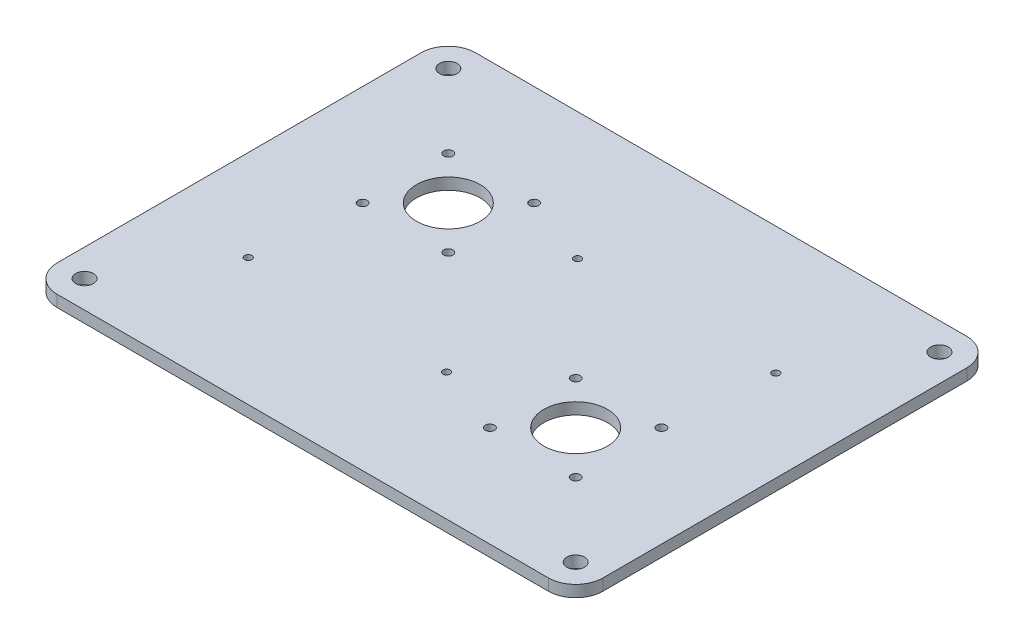
ISO-10303-21;
HEADER;
FILE_DESCRIPTION(('STEP AP214'),'2;1');
FILE_NAME('part.step','',(''),(''),'','','');
FILE_SCHEMA(('AUTOMOTIVE_DESIGN { 1 0 10303 214 1 1 1 1 }'));
ENDSEC;
DATA;
#1=APPLICATION_CONTEXT('core data for automotive mechanical design processes');
#2=APPLICATION_PROTOCOL_DEFINITION('international standard','automotive_design',2000,#1);
#3=PRODUCT_CONTEXT('',#1,'mechanical');
#4=PRODUCT('Part','Part','',(#3));
#5=PRODUCT_RELATED_PRODUCT_CATEGORY('part','',(#4));
#6=PRODUCT_DEFINITION_FORMATION('','',#4);
#7=PRODUCT_DEFINITION_CONTEXT('part definition',#1,'design');
#8=PRODUCT_DEFINITION('design','',#6,#7);
#9=PRODUCT_DEFINITION_SHAPE('','',#8);
#10=(LENGTH_UNIT() NAMED_UNIT(*) SI_UNIT(.MILLI.,.METRE.));
#11=(NAMED_UNIT(*) PLANE_ANGLE_UNIT() SI_UNIT($,.RADIAN.));
#12=(NAMED_UNIT(*) SI_UNIT($,.STERADIAN.) SOLID_ANGLE_UNIT());
#13=UNCERTAINTY_MEASURE_WITH_UNIT(LENGTH_MEASURE(1.E-05),#10,'distance_accuracy_value','');
#14=(GEOMETRIC_REPRESENTATION_CONTEXT(3) GLOBAL_UNCERTAINTY_ASSIGNED_CONTEXT((#13)) GLOBAL_UNIT_ASSIGNED_CONTEXT((#10,
#11,#12)) REPRESENTATION_CONTEXT('',''));
#15=CARTESIAN_POINT('',(0.,0.,0.));
#16=DIRECTION('',(0.,0.,1.));
#17=DIRECTION('',(1.,0.,0.));
#18=AXIS2_PLACEMENT_3D('',#15,#16,#17);
#19=CARTESIAN_POINT('',(-132.651439050945,6.35,-150.421561198845));
#20=DIRECTION('',(0.,-1.,0.));
#21=DIRECTION('',(0.,0.,-1.));
#22=AXIS2_PLACEMENT_3D('',#19,#20,#21);
#23=CYLINDRICAL_SURFACE('',#22,15.);
#24=CARTESIAN_POINT('',(-132.651439050945,0.,-150.421561198845));
#25=DIRECTION('',(0.,1.,0.));
#26=DIRECTION('',(0.,0.,1.));
#27=AXIS2_PLACEMENT_3D('',#24,#25,#26);
#28=CIRCLE('',#27,15.);
#29=CARTESIAN_POINT('',(-147.651439050945,0.,-150.421561198845));
#30=VERTEX_POINT('',#29);
#31=CARTESIAN_POINT('',(-132.651439050945,0.,-165.421561198845));
#32=VERTEX_POINT('',#31);
#33=EDGE_CURVE('E181',#30,#32,#28,.F.);
#34=ORIENTED_EDGE('',*,*,#33,.F.);
#35=DIRECTION('',(0.,-1.,0.));
#36=VECTOR('',#35,1.);
#37=CARTESIAN_POINT('',(-147.651439050945,6.35,-150.421561198845));
#38=LINE('',#37,#36);
#39=CARTESIAN_POINT('',(-147.651439050945,6.35,-150.421561198845));
#40=VERTEX_POINT('',#39);
#41=EDGE_CURVE('E11',#40,#30,#38,.T.);
#42=ORIENTED_EDGE('',*,*,#41,.F.);
#43=CARTESIAN_POINT('',(-132.651439050945,6.35,-150.421561198845));
#44=DIRECTION('',(0.,1.,0.));
#45=DIRECTION('',(0.,0.,1.));
#46=AXIS2_PLACEMENT_3D('',#43,#44,#45);
#47=CIRCLE('',#46,15.);
#48=CARTESIAN_POINT('',(-132.651439050945,6.35,-165.421561198845));
#49=VERTEX_POINT('',#48);
#50=EDGE_CURVE('E566',#40,#49,#47,.F.);
#51=ORIENTED_EDGE('',*,*,#50,.T.);
#52=DIRECTION('',(0.,-1.,0.));
#53=VECTOR('',#52,1.);
#54=CARTESIAN_POINT('',(-132.651439050945,6.35,-165.421561198845));
#55=LINE('',#54,#53);
#56=EDGE_CURVE('E58',#49,#32,#55,.T.);
#57=ORIENTED_EDGE('',*,*,#56,.T.);
#58=EDGE_LOOP('',(#34,#42,#51,#57));
#59=FACE_BOUND('',#58,.T.);
#60=ADVANCED_FACE('F41',(#59),#23,.T.);
#61=CARTESIAN_POINT('',(-147.651439050945,6.35,0.));
#62=DIRECTION('',(1.,0.,0.));
#63=DIRECTION('',(0.,0.,-1.));
#64=AXIS2_PLACEMENT_3D('',#61,#62,#63);
#65=PLANE('',#64);
#66=DIRECTION('',(0.,0.,1.));
#67=VECTOR('',#66,1.);
#68=CARTESIAN_POINT('',(-147.651439050945,0.,0.));
#69=LINE('',#68,#67);
#70=CARTESIAN_POINT('',(-147.651439050945,0.,49.578438801155));
#71=VERTEX_POINT('',#70);
#72=EDGE_CURVE('E183',#30,#71,#69,.T.);
#73=ORIENTED_EDGE('',*,*,#72,.T.);
#74=DIRECTION('',(0.,-1.,0.));
#75=VECTOR('',#74,1.);
#76=CARTESIAN_POINT('',(-147.651439050945,6.35,49.578438801155));
#77=LINE('',#76,#75);
#78=CARTESIAN_POINT('',(-147.651439050945,6.35,49.578438801155));
#79=VERTEX_POINT('',#78);
#80=EDGE_CURVE('E50',#79,#71,#77,.T.);
#81=ORIENTED_EDGE('',*,*,#80,.F.);
#82=DIRECTION('',(0.,0.,1.));
#83=VECTOR('',#82,1.);
#84=CARTESIAN_POINT('',(-147.651439050945,6.35,0.));
#85=LINE('',#84,#83);
#86=EDGE_CURVE('E568',#40,#79,#85,.T.);
#87=ORIENTED_EDGE('',*,*,#86,.F.);
#88=ORIENTED_EDGE('',*,*,#41,.T.);
#89=EDGE_LOOP('',(#73,#81,#87,#88));
#90=FACE_BOUND('',#89,.T.);
#91=ADVANCED_FACE('F225',(#90),#65,.F.);
#92=CARTESIAN_POINT('',(-132.651439050945,6.35,49.578438801155));
#93=DIRECTION('',(0.,-1.,0.));
#94=DIRECTION('',(0.,0.,-1.));
#95=AXIS2_PLACEMENT_3D('',#92,#93,#94);
#96=CYLINDRICAL_SURFACE('',#95,15.);
#97=CARTESIAN_POINT('',(-132.651439050945,0.,49.578438801155));
#98=DIRECTION('',(0.,1.,0.));
#99=DIRECTION('',(0.,0.,1.));
#100=AXIS2_PLACEMENT_3D('',#97,#98,#99);
#101=CIRCLE('',#100,15.);
#102=CARTESIAN_POINT('',(-132.651439050945,0.,64.578438801155));
#103=VERTEX_POINT('',#102);
#104=EDGE_CURVE('E186',#71,#103,#101,.T.);
#105=ORIENTED_EDGE('',*,*,#104,.T.);
#106=DIRECTION('',(0.,-1.,0.));
#107=VECTOR('',#106,1.);
#108=CARTESIAN_POINT('',(-132.651439050945,6.35,64.578438801155));
#109=LINE('',#108,#107);
#110=CARTESIAN_POINT('',(-132.651439050945,6.35,64.578438801155));
#111=VERTEX_POINT('',#110);
#112=EDGE_CURVE('E213',#111,#103,#109,.T.);
#113=ORIENTED_EDGE('',*,*,#112,.F.);
#114=CARTESIAN_POINT('',(-132.651439050945,6.35,49.578438801155));
#115=DIRECTION('',(0.,1.,0.));
#116=DIRECTION('',(0.,0.,1.));
#117=AXIS2_PLACEMENT_3D('',#114,#115,#116);
#118=CIRCLE('',#117,15.);
#119=EDGE_CURVE('E221',#79,#111,#118,.T.);
#120=ORIENTED_EDGE('',*,*,#119,.F.);
#121=ORIENTED_EDGE('',*,*,#80,.T.);
#122=EDGE_LOOP('',(#105,#113,#120,#121));
#123=FACE_BOUND('',#122,.T.);
#124=ADVANCED_FACE('F218',(#123),#96,.T.);
#125=CARTESIAN_POINT('',(0.,6.35,64.578438801155));
#126=DIRECTION('',(0.,0.,-1.));
#127=DIRECTION('',(-1.,0.,0.));
#128=AXIS2_PLACEMENT_3D('',#125,#126,#127);
#129=PLANE('',#128);
#130=DIRECTION('',(1.,0.,0.));
#131=VECTOR('',#130,1.);
#132=CARTESIAN_POINT('',(0.,0.,64.578438801155));
#133=LINE('',#132,#131);
#134=CARTESIAN_POINT('',(137.348560949055,0.,64.578438801155));
#135=VERTEX_POINT('',#134);
#136=EDGE_CURVE('E189',#103,#135,#133,.T.);
#137=ORIENTED_EDGE('',*,*,#136,.T.);
#138=DIRECTION('',(0.,-1.,0.));
#139=VECTOR('',#138,1.);
#140=CARTESIAN_POINT('',(137.348560949055,6.35,64.578438801155));
#141=LINE('',#140,#139);
#142=CARTESIAN_POINT('',(137.348560949055,6.35,64.578438801155));
#143=VERTEX_POINT('',#142);
#144=EDGE_CURVE('E211',#143,#135,#141,.T.);
#145=ORIENTED_EDGE('',*,*,#144,.F.);
#146=DIRECTION('',(1.,0.,0.));
#147=VECTOR('',#146,1.);
#148=CARTESIAN_POINT('',(0.,6.35,64.578438801155));
#149=LINE('',#148,#147);
#150=EDGE_CURVE('E133',#111,#143,#149,.T.);
#151=ORIENTED_EDGE('',*,*,#150,.F.);
#152=ORIENTED_EDGE('',*,*,#112,.T.);
#153=EDGE_LOOP('',(#137,#145,#151,#152));
#154=FACE_BOUND('',#153,.T.);
#155=ADVANCED_FACE('F353',(#154),#129,.F.);
#156=CARTESIAN_POINT('',(137.348560949055,6.35,49.578438801155));
#157=DIRECTION('',(0.,-1.,0.));
#158=DIRECTION('',(0.,0.,-1.));
#159=AXIS2_PLACEMENT_3D('',#156,#157,#158);
#160=CYLINDRICAL_SURFACE('',#159,15.);
#161=CARTESIAN_POINT('',(137.348560949055,0.,49.578438801155));
#162=DIRECTION('',(0.,1.,0.));
#163=DIRECTION('',(0.,0.,1.));
#164=AXIS2_PLACEMENT_3D('',#161,#162,#163);
#165=CIRCLE('',#164,15.);
#166=CARTESIAN_POINT('',(152.348560949055,0.,49.578438801155));
#167=VERTEX_POINT('',#166);
#168=EDGE_CURVE('E192',#167,#135,#165,.F.);
#169=ORIENTED_EDGE('',*,*,#168,.F.);
#170=DIRECTION('',(0.,-1.,0.));
#171=VECTOR('',#170,1.);
#172=CARTESIAN_POINT('',(152.348560949055,6.35,49.578438801155));
#173=LINE('',#172,#171);
#174=CARTESIAN_POINT('',(152.348560949055,6.35,49.578438801155));
#175=VERTEX_POINT('',#174);
#176=EDGE_CURVE('E118',#175,#167,#173,.T.);
#177=ORIENTED_EDGE('',*,*,#176,.F.);
#178=CARTESIAN_POINT('',(137.348560949055,6.35,49.578438801155));
#179=DIRECTION('',(0.,1.,0.));
#180=DIRECTION('',(0.,0.,1.));
#181=AXIS2_PLACEMENT_3D('',#178,#179,#180);
#182=CIRCLE('',#181,15.);
#183=EDGE_CURVE('E131',#175,#143,#182,.F.);
#184=ORIENTED_EDGE('',*,*,#183,.T.);
#185=ORIENTED_EDGE('',*,*,#144,.T.);
#186=EDGE_LOOP('',(#169,#177,#184,#185));
#187=FACE_BOUND('',#186,.T.);
#188=ADVANCED_FACE('F350',(#187),#160,.T.);
#189=CARTESIAN_POINT('',(152.348560949055,6.35,0.));
#190=DIRECTION('',(1.,0.,0.));
#191=DIRECTION('',(0.,0.,-1.));
#192=AXIS2_PLACEMENT_3D('',#189,#190,#191);
#193=PLANE('',#192);
#194=DIRECTION('',(0.,0.,1.));
#195=VECTOR('',#194,1.);
#196=CARTESIAN_POINT('',(152.348560949055,0.,0.));
#197=LINE('',#196,#195);
#198=CARTESIAN_POINT('',(152.348560949055,0.,-150.421561198845));
#199=VERTEX_POINT('',#198);
#200=EDGE_CURVE('E115',#199,#167,#197,.T.);
#201=ORIENTED_EDGE('',*,*,#200,.F.);
#202=DIRECTION('',(0.,-1.,0.));
#203=VECTOR('',#202,1.);
#204=CARTESIAN_POINT('',(152.348560949055,6.35,-150.421561198845));
#205=LINE('',#204,#203);
#206=CARTESIAN_POINT('',(152.348560949055,6.35,-150.421561198845));
#207=VERTEX_POINT('',#206);
#208=EDGE_CURVE('E109',#207,#199,#205,.T.);
#209=ORIENTED_EDGE('',*,*,#208,.F.);
#210=DIRECTION('',(0.,0.,1.));
#211=VECTOR('',#210,1.);
#212=CARTESIAN_POINT('',(152.348560949055,6.35,0.));
#213=LINE('',#212,#211);
#214=EDGE_CURVE('E113',#207,#175,#213,.T.);
#215=ORIENTED_EDGE('',*,*,#214,.T.);
#216=ORIENTED_EDGE('',*,*,#176,.T.);
#217=EDGE_LOOP('',(#201,#209,#215,#216));
#218=FACE_BOUND('',#217,.T.);
#219=ADVANCED_FACE('F111',(#218),#193,.T.);
#220=CARTESIAN_POINT('',(137.348560949055,6.35,-150.421561198845));
#221=DIRECTION('',(0.,-1.,0.));
#222=DIRECTION('',(0.,0.,-1.));
#223=AXIS2_PLACEMENT_3D('',#220,#221,#222);
#224=CYLINDRICAL_SURFACE('',#223,15.);
#225=CARTESIAN_POINT('',(137.348560949055,0.,-150.421561198845));
#226=DIRECTION('',(0.,1.,0.));
#227=DIRECTION('',(0.,0.,1.));
#228=AXIS2_PLACEMENT_3D('',#225,#226,#227);
#229=CIRCLE('',#228,15.);
#230=CARTESIAN_POINT('',(137.348560949055,0.,-165.421561198845));
#231=VERTEX_POINT('',#230);
#232=EDGE_CURVE('E196',#199,#231,#229,.T.);
#233=ORIENTED_EDGE('',*,*,#232,.T.);
#234=DIRECTION('',(0.,-1.,0.));
#235=VECTOR('',#234,1.);
#236=CARTESIAN_POINT('',(137.348560949055,6.35,-165.421561198845));
#237=LINE('',#236,#235);
#238=CARTESIAN_POINT('',(137.348560949055,6.35,-165.421561198845));
#239=VERTEX_POINT('',#238);
#240=EDGE_CURVE('E84',#239,#231,#237,.T.);
#241=ORIENTED_EDGE('',*,*,#240,.F.);
#242=CARTESIAN_POINT('',(137.348560949055,6.35,-150.421561198845));
#243=DIRECTION('',(0.,1.,0.));
#244=DIRECTION('',(0.,0.,1.));
#245=AXIS2_PLACEMENT_3D('',#242,#243,#244);
#246=CIRCLE('',#245,15.);
#247=EDGE_CURVE('E120',#207,#239,#246,.T.);
#248=ORIENTED_EDGE('',*,*,#247,.F.);
#249=ORIENTED_EDGE('',*,*,#208,.T.);
#250=EDGE_LOOP('',(#233,#241,#248,#249));
#251=FACE_BOUND('',#250,.T.);
#252=ADVANCED_FACE('F121',(#251),#224,.T.);
#253=CARTESIAN_POINT('',(-132.651439050945,6.35,-150.421561198845));
#254=DIRECTION('',(0.,-1.,0.));
#255=DIRECTION('',(0.,0.,-1.));
#256=AXIS2_PLACEMENT_3D('',#253,#254,#255);
#257=CYLINDRICAL_SURFACE('',#256,4.85);
#258=CARTESIAN_POINT('',(-132.651439050945,6.35,-150.421561198845));
#259=DIRECTION('',(0.,1.,0.));
#260=DIRECTION('',(0.,0.,1.));
#261=AXIS2_PLACEMENT_3D('',#258,#259,#260);
#262=CIRCLE('',#261,4.85);
#263=CARTESIAN_POINT('',(-132.651439050945,6.35,-145.571561198845));
#264=VERTEX_POINT('',#263);
#265=EDGE_CURVE('E138',#264,#264,#262,.T.);
#266=ORIENTED_EDGE('',*,*,#265,.T.);
#267=EDGE_LOOP('',(#266));
#268=FACE_BOUND('',#267,.T.);
#269=CARTESIAN_POINT('',(-132.651439050945,0.,-150.421561198845));
#270=DIRECTION('',(0.,1.,0.));
#271=DIRECTION('',(0.,0.,1.));
#272=AXIS2_PLACEMENT_3D('',#269,#270,#271);
#273=CIRCLE('',#272,4.85);
#274=CARTESIAN_POINT('',(-132.651439050945,0.,-145.571561198845));
#275=VERTEX_POINT('',#274);
#276=EDGE_CURVE('E201',#275,#275,#273,.T.);
#277=ORIENTED_EDGE('',*,*,#276,.F.);
#278=EDGE_LOOP('',(#277));
#279=FACE_BOUND('',#278,.T.);
#280=ADVANCED_FACE('F340',(#268,#279),#257,.F.);
#281=CARTESIAN_POINT('',(0.,6.35,-165.421561198845));
#282=DIRECTION('',(0.,0.,-1.));
#283=DIRECTION('',(-1.,0.,0.));
#284=AXIS2_PLACEMENT_3D('',#281,#282,#283);
#285=PLANE('',#284);
#286=DIRECTION('',(1.,0.,0.));
#287=VECTOR('',#286,1.);
#288=CARTESIAN_POINT('',(0.,0.,-165.421561198845));
#289=LINE('',#288,#287);
#290=EDGE_CURVE('E198',#32,#231,#289,.T.);
#291=ORIENTED_EDGE('',*,*,#290,.F.);
#292=ORIENTED_EDGE('',*,*,#56,.F.);
#293=DIRECTION('',(1.,0.,0.));
#294=VECTOR('',#293,1.);
#295=CARTESIAN_POINT('',(0.,6.35,-165.421561198845));
#296=LINE('',#295,#294);
#297=EDGE_CURVE('E124',#49,#239,#296,.T.);
#298=ORIENTED_EDGE('',*,*,#297,.T.);
#299=ORIENTED_EDGE('',*,*,#240,.T.);
#300=EDGE_LOOP('',(#291,#292,#298,#299));
#301=FACE_BOUND('',#300,.T.);
#302=ADVANCED_FACE('F241',(#301),#285,.T.);
#303=CARTESIAN_POINT('',(137.348560949055,6.35,49.578438801155));
#304=DIRECTION('',(0.,-1.,0.));
#305=DIRECTION('',(0.,0.,-1.));
#306=AXIS2_PLACEMENT_3D('',#303,#304,#305);
#307=CYLINDRICAL_SURFACE('',#306,4.85);
#308=CARTESIAN_POINT('',(137.348560949055,6.35,49.578438801155));
#309=DIRECTION('',(0.,1.,0.));
#310=DIRECTION('',(0.,0.,1.));
#311=AXIS2_PLACEMENT_3D('',#308,#309,#310);
#312=CIRCLE('',#311,4.85);
#313=CARTESIAN_POINT('',(137.348560949055,6.35,54.428438801155));
#314=VERTEX_POINT('',#313);
#315=EDGE_CURVE('E563',#314,#314,#312,.T.);
#316=ORIENTED_EDGE('',*,*,#315,.T.);
#317=EDGE_LOOP('',(#316));
#318=FACE_BOUND('',#317,.T.);
#319=CARTESIAN_POINT('',(137.348560949055,0.,49.578438801155));
#320=DIRECTION('',(0.,1.,0.));
#321=DIRECTION('',(0.,0.,1.));
#322=AXIS2_PLACEMENT_3D('',#319,#320,#321);
#323=CIRCLE('',#322,4.85);
#324=CARTESIAN_POINT('',(137.348560949055,0.,54.428438801155));
#325=VERTEX_POINT('',#324);
#326=EDGE_CURVE('E178',#325,#325,#323,.T.);
#327=ORIENTED_EDGE('',*,*,#326,.F.);
#328=EDGE_LOOP('',(#327));
#329=FACE_BOUND('',#328,.T.);
#330=ADVANCED_FACE('F237',(#318,#329),#307,.F.);
#331=CARTESIAN_POINT('',(-45.0814390509446,6.35,-109.991561198845));
#332=DIRECTION('',(0.,-1.,0.));
#333=DIRECTION('',(0.,0.,-1.));
#334=AXIS2_PLACEMENT_3D('',#331,#332,#333);
#335=CYLINDRICAL_SURFACE('',#334,2.5);
#336=CARTESIAN_POINT('',(-45.0814390509446,6.35,-109.991561198845));
#337=DIRECTION('',(0.,1.,0.));
#338=DIRECTION('',(0.,0.,1.));
#339=AXIS2_PLACEMENT_3D('',#336,#337,#338);
#340=CIRCLE('',#339,2.5);
#341=CARTESIAN_POINT('',(-45.0814390509446,6.35,-107.491561198845));
#342=VERTEX_POINT('',#341);
#343=EDGE_CURVE('E560',#342,#342,#340,.T.);
#344=ORIENTED_EDGE('',*,*,#343,.T.);
#345=EDGE_LOOP('',(#344));
#346=FACE_BOUND('',#345,.T.);
#347=CARTESIAN_POINT('',(-45.0814390509446,0.,-109.991561198845));
#348=DIRECTION('',(0.,1.,0.));
#349=DIRECTION('',(0.,0.,1.));
#350=AXIS2_PLACEMENT_3D('',#347,#348,#349);
#351=CIRCLE('',#350,2.5);
#352=CARTESIAN_POINT('',(-45.0814390509446,0.,-107.491561198845));
#353=VERTEX_POINT('',#352);
#354=EDGE_CURVE('E175',#353,#353,#351,.T.);
#355=ORIENTED_EDGE('',*,*,#354,.F.);
#356=EDGE_LOOP('',(#355));
#357=FACE_BOUND('',#356,.T.);
#358=ADVANCED_FACE('F240',(#346,#357),#335,.F.);
#359=CARTESIAN_POINT('',(-45.0814390509446,6.35,-62.851561198845));
#360=DIRECTION('',(0.,-1.,0.));
#361=DIRECTION('',(0.,0.,-1.));
#362=AXIS2_PLACEMENT_3D('',#359,#360,#361);
#363=CYLINDRICAL_SURFACE('',#362,2.5);
#364=CARTESIAN_POINT('',(-45.0814390509446,6.35,-62.851561198845));
#365=DIRECTION('',(0.,1.,0.));
#366=DIRECTION('',(0.,0.,1.));
#367=AXIS2_PLACEMENT_3D('',#364,#365,#366);
#368=CIRCLE('',#367,2.5);
#369=CARTESIAN_POINT('',(-45.0814390509446,6.35,-60.351561198845));
#370=VERTEX_POINT('',#369);
#371=EDGE_CURVE('E557',#370,#370,#368,.T.);
#372=ORIENTED_EDGE('',*,*,#371,.T.);
#373=EDGE_LOOP('',(#372));
#374=FACE_BOUND('',#373,.T.);
#375=CARTESIAN_POINT('',(-45.0814390509446,0.,-62.851561198845));
#376=DIRECTION('',(0.,1.,0.));
#377=DIRECTION('',(0.,0.,1.));
#378=AXIS2_PLACEMENT_3D('',#375,#376,#377);
#379=CIRCLE('',#378,2.5);
#380=CARTESIAN_POINT('',(-45.0814390509446,0.,-60.351561198845));
#381=VERTEX_POINT('',#380);
#382=EDGE_CURVE('E172',#381,#381,#379,.T.);
#383=ORIENTED_EDGE('',*,*,#382,.F.);
#384=EDGE_LOOP('',(#383));
#385=FACE_BOUND('',#384,.T.);
#386=ADVANCED_FACE('F245',(#374,#385),#363,.F.);
#387=CARTESIAN_POINT('',(-92.2214390509446,6.35,-62.851561198845));
#388=DIRECTION('',(0.,-1.,0.));
#389=DIRECTION('',(0.,0.,-1.));
#390=AXIS2_PLACEMENT_3D('',#387,#388,#389);
#391=CYLINDRICAL_SURFACE('',#390,2.50000000000001);
#392=CARTESIAN_POINT('',(-92.2214390509446,6.35,-62.851561198845));
#393=DIRECTION('',(0.,1.,0.));
#394=DIRECTION('',(0.,0.,1.));
#395=AXIS2_PLACEMENT_3D('',#392,#393,#394);
#396=CIRCLE('',#395,2.50000000000001);
#397=CARTESIAN_POINT('',(-92.2214390509446,6.35,-60.351561198845));
#398=VERTEX_POINT('',#397);
#399=EDGE_CURVE('E554',#398,#398,#396,.T.);
#400=ORIENTED_EDGE('',*,*,#399,.T.);
#401=EDGE_LOOP('',(#400));
#402=FACE_BOUND('',#401,.T.);
#403=CARTESIAN_POINT('',(-92.2214390509446,0.,-62.851561198845));
#404=DIRECTION('',(0.,1.,0.));
#405=DIRECTION('',(0.,0.,1.));
#406=AXIS2_PLACEMENT_3D('',#403,#404,#405);
#407=CIRCLE('',#406,2.50000000000001);
#408=CARTESIAN_POINT('',(-92.2214390509446,0.,-60.351561198845));
#409=VERTEX_POINT('',#408);
#410=EDGE_CURVE('E169',#409,#409,#407,.T.);
#411=ORIENTED_EDGE('',*,*,#410,.F.);
#412=EDGE_LOOP('',(#411));
#413=FACE_BOUND('',#412,.T.);
#414=ADVANCED_FACE('F249',(#402,#413),#391,.F.);
#415=CARTESIAN_POINT('',(-92.2214390509446,6.35,-109.991561198845));
#416=DIRECTION('',(0.,-1.,0.));
#417=DIRECTION('',(0.,0.,-1.));
#418=AXIS2_PLACEMENT_3D('',#415,#416,#417);
#419=CYLINDRICAL_SURFACE('',#418,2.5);
#420=CARTESIAN_POINT('',(-92.2214390509446,6.35,-109.991561198845));
#421=DIRECTION('',(0.,1.,0.));
#422=DIRECTION('',(0.,0.,1.));
#423=AXIS2_PLACEMENT_3D('',#420,#421,#422);
#424=CIRCLE('',#423,2.5);
#425=CARTESIAN_POINT('',(-92.2214390509446,6.35,-107.491561198845));
#426=VERTEX_POINT('',#425);
#427=EDGE_CURVE('E551',#426,#426,#424,.T.);
#428=ORIENTED_EDGE('',*,*,#427,.T.);
#429=EDGE_LOOP('',(#428));
#430=FACE_BOUND('',#429,.T.);
#431=CARTESIAN_POINT('',(-92.2214390509446,0.,-109.991561198845));
#432=DIRECTION('',(0.,1.,0.));
#433=DIRECTION('',(0.,0.,1.));
#434=AXIS2_PLACEMENT_3D('',#431,#432,#433);
#435=CIRCLE('',#434,2.5);
#436=CARTESIAN_POINT('',(-92.2214390509446,0.,-107.491561198845));
#437=VERTEX_POINT('',#436);
#438=EDGE_CURVE('E166',#437,#437,#435,.T.);
#439=ORIENTED_EDGE('',*,*,#438,.F.);
#440=EDGE_LOOP('',(#439));
#441=FACE_BOUND('',#440,.T.);
#442=ADVANCED_FACE('F253',(#430,#441),#419,.F.);
#443=CARTESIAN_POINT('',(49.7785609490553,6.35,-37.991561198845));
#444=DIRECTION('',(0.,-1.,0.));
#445=DIRECTION('',(0.,0.,-1.));
#446=AXIS2_PLACEMENT_3D('',#443,#444,#445);
#447=CYLINDRICAL_SURFACE('',#446,2.5);
#448=CARTESIAN_POINT('',(49.7785609490553,6.35,-37.991561198845));
#449=DIRECTION('',(0.,1.,0.));
#450=DIRECTION('',(0.,0.,1.));
#451=AXIS2_PLACEMENT_3D('',#448,#449,#450);
#452=CIRCLE('',#451,2.5);
#453=CARTESIAN_POINT('',(49.7785609490553,6.35,-35.491561198845));
#454=VERTEX_POINT('',#453);
#455=EDGE_CURVE('E548',#454,#454,#452,.T.);
#456=ORIENTED_EDGE('',*,*,#455,.T.);
#457=EDGE_LOOP('',(#456));
#458=FACE_BOUND('',#457,.T.);
#459=CARTESIAN_POINT('',(49.7785609490553,0.,-37.991561198845));
#460=DIRECTION('',(0.,1.,0.));
#461=DIRECTION('',(0.,0.,1.));
#462=AXIS2_PLACEMENT_3D('',#459,#460,#461);
#463=CIRCLE('',#462,2.5);
#464=CARTESIAN_POINT('',(49.7785609490553,0.,-35.491561198845));
#465=VERTEX_POINT('',#464);
#466=EDGE_CURVE('E163',#465,#465,#463,.T.);
#467=ORIENTED_EDGE('',*,*,#466,.F.);
#468=EDGE_LOOP('',(#467));
#469=FACE_BOUND('',#468,.T.);
#470=ADVANCED_FACE('F257',(#458,#469),#447,.F.);
#471=CARTESIAN_POINT('',(96.9185609490554,6.35,-37.991561198845));
#472=DIRECTION('',(0.,-1.,0.));
#473=DIRECTION('',(0.,0.,-1.));
#474=AXIS2_PLACEMENT_3D('',#471,#472,#473);
#475=CYLINDRICAL_SURFACE('',#474,2.5);
#476=CARTESIAN_POINT('',(96.9185609490554,6.35,-37.991561198845));
#477=DIRECTION('',(0.,1.,0.));
#478=DIRECTION('',(0.,0.,1.));
#479=AXIS2_PLACEMENT_3D('',#476,#477,#478);
#480=CIRCLE('',#479,2.5);
#481=CARTESIAN_POINT('',(96.9185609490554,6.35,-35.491561198845));
#482=VERTEX_POINT('',#481);
#483=EDGE_CURVE('E545',#482,#482,#480,.T.);
#484=ORIENTED_EDGE('',*,*,#483,.T.);
#485=EDGE_LOOP('',(#484));
#486=FACE_BOUND('',#485,.T.);
#487=CARTESIAN_POINT('',(96.9185609490554,0.,-37.991561198845));
#488=DIRECTION('',(0.,1.,0.));
#489=DIRECTION('',(0.,0.,1.));
#490=AXIS2_PLACEMENT_3D('',#487,#488,#489);
#491=CIRCLE('',#490,2.5);
#492=CARTESIAN_POINT('',(96.9185609490554,0.,-35.491561198845));
#493=VERTEX_POINT('',#492);
#494=EDGE_CURVE('E160',#493,#493,#491,.T.);
#495=ORIENTED_EDGE('',*,*,#494,.F.);
#496=EDGE_LOOP('',(#495));
#497=FACE_BOUND('',#496,.T.);
#498=ADVANCED_FACE('F261',(#486,#497),#475,.F.);
#499=CARTESIAN_POINT('',(96.9185609490554,6.35,9.14843880115503));
#500=DIRECTION('',(0.,-1.,0.));
#501=DIRECTION('',(0.,0.,-1.));
#502=AXIS2_PLACEMENT_3D('',#499,#500,#501);
#503=CYLINDRICAL_SURFACE('',#502,2.49999999999999);
#504=CARTESIAN_POINT('',(96.9185609490554,6.35,9.14843880115503));
#505=DIRECTION('',(0.,1.,0.));
#506=DIRECTION('',(0.,0.,1.));
#507=AXIS2_PLACEMENT_3D('',#504,#505,#506);
#508=CIRCLE('',#507,2.49999999999999);
#509=CARTESIAN_POINT('',(96.9185609490554,6.35,11.648438801155));
#510=VERTEX_POINT('',#509);
#511=EDGE_CURVE('E542',#510,#510,#508,.T.);
#512=ORIENTED_EDGE('',*,*,#511,.T.);
#513=EDGE_LOOP('',(#512));
#514=FACE_BOUND('',#513,.T.);
#515=CARTESIAN_POINT('',(96.9185609490554,0.,9.14843880115503));
#516=DIRECTION('',(0.,1.,0.));
#517=DIRECTION('',(0.,0.,1.));
#518=AXIS2_PLACEMENT_3D('',#515,#516,#517);
#519=CIRCLE('',#518,2.49999999999999);
#520=CARTESIAN_POINT('',(96.9185609490554,0.,11.648438801155));
#521=VERTEX_POINT('',#520);
#522=EDGE_CURVE('E157',#521,#521,#519,.T.);
#523=ORIENTED_EDGE('',*,*,#522,.F.);
#524=EDGE_LOOP('',(#523));
#525=FACE_BOUND('',#524,.T.);
#526=ADVANCED_FACE('F265',(#514,#525),#503,.F.);
#527=CARTESIAN_POINT('',(49.7785609490553,6.35,9.14843880115503));
#528=DIRECTION('',(0.,-1.,0.));
#529=DIRECTION('',(0.,0.,-1.));
#530=AXIS2_PLACEMENT_3D('',#527,#528,#529);
#531=CYLINDRICAL_SURFACE('',#530,2.49999999999999);
#532=CARTESIAN_POINT('',(49.7785609490553,6.35,9.14843880115503));
#533=DIRECTION('',(0.,1.,0.));
#534=DIRECTION('',(0.,0.,1.));
#535=AXIS2_PLACEMENT_3D('',#532,#533,#534);
#536=CIRCLE('',#535,2.49999999999999);
#537=CARTESIAN_POINT('',(49.7785609490553,6.35,11.648438801155));
#538=VERTEX_POINT('',#537);
#539=EDGE_CURVE('E539',#538,#538,#536,.T.);
#540=ORIENTED_EDGE('',*,*,#539,.T.);
#541=EDGE_LOOP('',(#540));
#542=FACE_BOUND('',#541,.T.);
#543=CARTESIAN_POINT('',(49.7785609490553,0.,9.14843880115503));
#544=DIRECTION('',(0.,1.,0.));
#545=DIRECTION('',(0.,0.,1.));
#546=AXIS2_PLACEMENT_3D('',#543,#544,#545);
#547=CIRCLE('',#546,2.49999999999999);
#548=CARTESIAN_POINT('',(49.7785609490553,0.,11.648438801155));
#549=VERTEX_POINT('',#548);
#550=EDGE_CURVE('E154',#549,#549,#547,.T.);
#551=ORIENTED_EDGE('',*,*,#550,.F.);
#552=EDGE_LOOP('',(#551));
#553=FACE_BOUND('',#552,.T.);
#554=ADVANCED_FACE('F269',(#542,#553),#531,.F.);
#555=CARTESIAN_POINT('',(137.348560949055,6.35,-150.421561198845));
#556=DIRECTION('',(0.,-1.,0.));
#557=DIRECTION('',(0.,0.,-1.));
#558=AXIS2_PLACEMENT_3D('',#555,#556,#557);
#559=CYLINDRICAL_SURFACE('',#558,4.85);
#560=CARTESIAN_POINT('',(137.348560949055,6.35,-150.421561198845));
#561=DIRECTION('',(0.,1.,0.));
#562=DIRECTION('',(0.,0.,1.));
#563=AXIS2_PLACEMENT_3D('',#560,#561,#562);
#564=CIRCLE('',#563,4.85);
#565=CARTESIAN_POINT('',(137.348560949055,6.35,-145.571561198845));
#566=VERTEX_POINT('',#565);
#567=EDGE_CURVE('E536',#566,#566,#564,.F.);
#568=ORIENTED_EDGE('',*,*,#567,.F.);
#569=EDGE_LOOP('',(#568));
#570=FACE_BOUND('',#569,.T.);
#571=CARTESIAN_POINT('',(137.348560949055,0.,-150.421561198845));
#572=DIRECTION('',(0.,1.,0.));
#573=DIRECTION('',(0.,0.,1.));
#574=AXIS2_PLACEMENT_3D('',#571,#572,#573);
#575=CIRCLE('',#574,4.85);
#576=CARTESIAN_POINT('',(137.348560949055,0.,-145.571561198845));
#577=VERTEX_POINT('',#576);
#578=EDGE_CURVE('E151',#577,#577,#575,.F.);
#579=ORIENTED_EDGE('',*,*,#578,.T.);
#580=EDGE_LOOP('',(#579));
#581=FACE_BOUND('',#580,.T.);
#582=ADVANCED_FACE('F273',(#570,#581),#559,.F.);
#583=CARTESIAN_POINT('',(-68.6514390509447,6.35,-86.421561198845));
#584=DIRECTION('',(0.,-1.,0.));
#585=DIRECTION('',(0.,0.,-1.));
#586=AXIS2_PLACEMENT_3D('',#583,#584,#585);
#587=CYLINDRICAL_SURFACE('',#586,17.5);
#588=CARTESIAN_POINT('',(-68.6514390509447,6.35,-86.421561198845));
#589=DIRECTION('',(0.,1.,0.));
#590=DIRECTION('',(0.,0.,1.));
#591=AXIS2_PLACEMENT_3D('',#588,#589,#590);
#592=CIRCLE('',#591,17.5);
#593=CARTESIAN_POINT('',(-68.6514390509447,6.35,-68.921561198845));
#594=VERTEX_POINT('',#593);
#595=EDGE_CURVE('E288',#594,#594,#592,.T.);
#596=ORIENTED_EDGE('',*,*,#595,.T.);
#597=EDGE_LOOP('',(#596));
#598=FACE_BOUND('',#597,.T.);
#599=CARTESIAN_POINT('',(-68.6514390509447,0.,-86.421561198845));
#600=DIRECTION('',(0.,1.,0.));
#601=DIRECTION('',(0.,0.,1.));
#602=AXIS2_PLACEMENT_3D('',#599,#600,#601);
#603=CIRCLE('',#602,17.5);
#604=CARTESIAN_POINT('',(-68.6514390509447,0.,-68.921561198845));
#605=VERTEX_POINT('',#604);
#606=EDGE_CURVE('E147',#605,#605,#603,.T.);
#607=ORIENTED_EDGE('',*,*,#606,.F.);
#608=EDGE_LOOP('',(#607));
#609=FACE_BOUND('',#608,.T.);
#610=ADVANCED_FACE('F276',(#598,#609),#587,.F.);
#611=CARTESIAN_POINT('',(73.3485609490553,6.35,-14.421561198845));
#612=DIRECTION('',(0.,-1.,0.));
#613=DIRECTION('',(0.,0.,-1.));
#614=AXIS2_PLACEMENT_3D('',#611,#612,#613);
#615=CYLINDRICAL_SURFACE('',#614,17.5);
#616=CARTESIAN_POINT('',(73.3485609490553,6.35,-14.421561198845));
#617=DIRECTION('',(0.,1.,0.));
#618=DIRECTION('',(0.,0.,1.));
#619=AXIS2_PLACEMENT_3D('',#616,#617,#618);
#620=CIRCLE('',#619,17.5);
#621=CARTESIAN_POINT('',(73.3485609490553,6.35,3.078438801155));
#622=VERTEX_POINT('',#621);
#623=EDGE_CURVE('E207',#622,#622,#620,.T.);
#624=ORIENTED_EDGE('',*,*,#623,.T.);
#625=EDGE_LOOP('',(#624));
#626=FACE_BOUND('',#625,.T.);
#627=CARTESIAN_POINT('',(73.3485609490553,0.,-14.421561198845));
#628=DIRECTION('',(0.,1.,0.));
#629=DIRECTION('',(0.,0.,1.));
#630=AXIS2_PLACEMENT_3D('',#627,#628,#629);
#631=CIRCLE('',#630,17.5);
#632=CARTESIAN_POINT('',(73.3485609490553,0.,3.078438801155));
#633=VERTEX_POINT('',#632);
#634=EDGE_CURVE('E144',#633,#633,#631,.T.);
#635=ORIENTED_EDGE('',*,*,#634,.F.);
#636=EDGE_LOOP('',(#635));
#637=FACE_BOUND('',#636,.T.);
#638=ADVANCED_FACE('F43',(#626,#637),#615,.F.);
#639=CARTESIAN_POINT('',(-132.651439050945,6.35,49.578438801155));
#640=DIRECTION('',(0.,-1.,0.));
#641=DIRECTION('',(0.,0.,-1.));
#642=AXIS2_PLACEMENT_3D('',#639,#640,#641);
#643=CYLINDRICAL_SURFACE('',#642,4.85);
#644=CARTESIAN_POINT('',(-132.651439050945,6.35,49.578438801155));
#645=DIRECTION('',(0.,1.,0.));
#646=DIRECTION('',(0.,0.,1.));
#647=AXIS2_PLACEMENT_3D('',#644,#645,#646);
#648=CIRCLE('',#647,4.85);
#649=CARTESIAN_POINT('',(-132.651439050945,6.35,54.428438801155));
#650=VERTEX_POINT('',#649);
#651=EDGE_CURVE('E141',#650,#650,#648,.F.);
#652=ORIENTED_EDGE('',*,*,#651,.F.);
#653=EDGE_LOOP('',(#652));
#654=FACE_BOUND('',#653,.T.);
#655=CARTESIAN_POINT('',(-132.651439050945,0.,49.578438801155));
#656=DIRECTION('',(0.,1.,0.));
#657=DIRECTION('',(0.,0.,1.));
#658=AXIS2_PLACEMENT_3D('',#655,#656,#657);
#659=CIRCLE('',#658,4.85);
#660=CARTESIAN_POINT('',(-132.651439050945,0.,54.428438801155));
#661=VERTEX_POINT('',#660);
#662=EDGE_CURVE('E204',#661,#661,#659,.F.);
#663=ORIENTED_EDGE('',*,*,#662,.T.);
#664=EDGE_LOOP('',(#663));
#665=FACE_BOUND('',#664,.T.);
#666=ADVANCED_FACE('F283',(#654,#665),#643,.F.);
#667=CARTESIAN_POINT('',(0.,6.35,0.));
#668=DIRECTION('',(0.,1.,0.));
#669=DIRECTION('',(0.,0.,1.));
#670=AXIS2_PLACEMENT_3D('',#667,#668,#669);
#671=PLANE('',#670);
#672=CARTESIAN_POINT('',(-97.6514390509447,6.35,-5.42156119884502));
#673=DIRECTION('',(0.,1.,0.));
#674=DIRECTION('',(0.,0.,1.));
#675=AXIS2_PLACEMENT_3D('',#672,#673,#674);
#676=CIRCLE('',#675,2.);
#677=CARTESIAN_POINT('',(-97.6514390509447,6.35,-3.42156119884502));
#678=VERTEX_POINT('',#677);
#679=EDGE_CURVE('E148',#678,#678,#676,.T.);
#680=ORIENTED_EDGE('',*,*,#679,.F.);
#681=EDGE_LOOP('',(#680));
#682=FACE_BOUND('',#681,.T.);
#683=CARTESIAN_POINT('',(11.3485609490553,6.35,-5.42156119884502));
#684=DIRECTION('',(0.,1.,0.));
#685=DIRECTION('',(0.,0.,1.));
#686=AXIS2_PLACEMENT_3D('',#683,#684,#685);
#687=CIRCLE('',#686,2.);
#688=CARTESIAN_POINT('',(11.3485609490553,6.35,-3.42156119884501));
#689=VERTEX_POINT('',#688);
#690=EDGE_CURVE('E529',#689,#689,#687,.T.);
#691=ORIENTED_EDGE('',*,*,#690,.F.);
#692=EDGE_LOOP('',(#691));
#693=FACE_BOUND('',#692,.T.);
#694=CARTESIAN_POINT('',(-6.65143905094472,6.35,-95.421561198845));
#695=DIRECTION('',(0.,1.,0.));
#696=DIRECTION('',(0.,0.,1.));
#697=AXIS2_PLACEMENT_3D('',#694,#695,#696);
#698=CIRCLE('',#697,2.);
#699=CARTESIAN_POINT('',(-6.65143905094472,6.35,-93.421561198845));
#700=VERTEX_POINT('',#699);
#701=EDGE_CURVE('E516',#700,#700,#698,.T.);
#702=ORIENTED_EDGE('',*,*,#701,.F.);
#703=EDGE_LOOP('',(#702));
#704=FACE_BOUND('',#703,.T.);
#705=CARTESIAN_POINT('',(102.348560949055,6.35,-95.421561198845));
#706=DIRECTION('',(0.,1.,0.));
#707=DIRECTION('',(0.,0.,1.));
#708=AXIS2_PLACEMENT_3D('',#705,#706,#707);
#709=CIRCLE('',#708,2.);
#710=CARTESIAN_POINT('',(102.348560949055,6.35,-93.421561198845));
#711=VERTEX_POINT('',#710);
#712=EDGE_CURVE('E512',#711,#711,#709,.T.);
#713=ORIENTED_EDGE('',*,*,#712,.F.);
#714=EDGE_LOOP('',(#713));
#715=FACE_BOUND('',#714,.T.);
#716=ORIENTED_EDGE('',*,*,#623,.F.);
#717=EDGE_LOOP('',(#716));
#718=FACE_BOUND('',#717,.T.);
#719=ORIENTED_EDGE('',*,*,#595,.F.);
#720=EDGE_LOOP('',(#719));
#721=FACE_BOUND('',#720,.T.);
#722=ORIENTED_EDGE('',*,*,#567,.T.);
#723=EDGE_LOOP('',(#722));
#724=FACE_BOUND('',#723,.T.);
#725=ORIENTED_EDGE('',*,*,#539,.F.);
#726=EDGE_LOOP('',(#725));
#727=FACE_BOUND('',#726,.T.);
#728=ORIENTED_EDGE('',*,*,#511,.F.);
#729=EDGE_LOOP('',(#728));
#730=FACE_BOUND('',#729,.T.);
#731=ORIENTED_EDGE('',*,*,#483,.F.);
#732=EDGE_LOOP('',(#731));
#733=FACE_BOUND('',#732,.T.);
#734=ORIENTED_EDGE('',*,*,#455,.F.);
#735=EDGE_LOOP('',(#734));
#736=FACE_BOUND('',#735,.T.);
#737=ORIENTED_EDGE('',*,*,#427,.F.);
#738=EDGE_LOOP('',(#737));
#739=FACE_BOUND('',#738,.T.);
#740=ORIENTED_EDGE('',*,*,#399,.F.);
#741=EDGE_LOOP('',(#740));
#742=FACE_BOUND('',#741,.T.);
#743=ORIENTED_EDGE('',*,*,#371,.F.);
#744=EDGE_LOOP('',(#743));
#745=FACE_BOUND('',#744,.T.);
#746=ORIENTED_EDGE('',*,*,#343,.F.);
#747=EDGE_LOOP('',(#746));
#748=FACE_BOUND('',#747,.T.);
#749=ORIENTED_EDGE('',*,*,#315,.F.);
#750=EDGE_LOOP('',(#749));
#751=FACE_BOUND('',#750,.T.);
#752=ORIENTED_EDGE('',*,*,#50,.F.);
#753=ORIENTED_EDGE('',*,*,#86,.T.);
#754=ORIENTED_EDGE('',*,*,#119,.T.);
#755=ORIENTED_EDGE('',*,*,#150,.T.);
#756=ORIENTED_EDGE('',*,*,#183,.F.);
#757=ORIENTED_EDGE('',*,*,#214,.F.);
#758=ORIENTED_EDGE('',*,*,#247,.T.);
#759=ORIENTED_EDGE('',*,*,#297,.F.);
#760=EDGE_LOOP('',(#752,#753,#754,#755,#756,#757,#758,#759));
#761=FACE_BOUND('',#760,.T.);
#762=ORIENTED_EDGE('',*,*,#265,.F.);
#763=EDGE_LOOP('',(#762));
#764=FACE_BOUND('',#763,.T.);
#765=ORIENTED_EDGE('',*,*,#651,.T.);
#766=EDGE_LOOP('',(#765));
#767=FACE_BOUND('',#766,.T.);
#768=ADVANCED_FACE('F128',(#682,#693,#704,#715,#718,#721,#724,#727,#730,#733,#736,#739,#742,
#745,#748,#751,#761,#764,#767),#671,.T.);
#769=CARTESIAN_POINT('',(0.,0.,0.));
#770=DIRECTION('',(0.,1.,0.));
#771=DIRECTION('',(0.,0.,1.));
#772=AXIS2_PLACEMENT_3D('',#769,#770,#771);
#773=PLANE('',#772);
#774=CARTESIAN_POINT('',(-97.6514390509447,0.,-5.42156119884502));
#775=DIRECTION('',(0.,-1.,0.));
#776=DIRECTION('',(0.,0.,-1.));
#777=AXIS2_PLACEMENT_3D('',#774,#775,#776);
#778=CIRCLE('',#777,2.);
#779=CARTESIAN_POINT('',(-97.6514390509447,0.,-7.42156119884501));
#780=VERTEX_POINT('',#779);
#781=EDGE_CURVE('E511',#780,#780,#778,.T.);
#782=ORIENTED_EDGE('',*,*,#781,.F.);
#783=EDGE_LOOP('',(#782));
#784=FACE_BOUND('',#783,.T.);
#785=CARTESIAN_POINT('',(11.3485609490553,0.,-5.42156119884502));
#786=DIRECTION('',(0.,-1.,0.));
#787=DIRECTION('',(0.,0.,-1.));
#788=AXIS2_PLACEMENT_3D('',#785,#786,#787);
#789=CIRCLE('',#788,2.);
#790=CARTESIAN_POINT('',(11.3485609490553,0.,-7.42156119884502));
#791=VERTEX_POINT('',#790);
#792=EDGE_CURVE('E513',#791,#791,#789,.T.);
#793=ORIENTED_EDGE('',*,*,#792,.F.);
#794=EDGE_LOOP('',(#793));
#795=FACE_BOUND('',#794,.T.);
#796=CARTESIAN_POINT('',(-6.65143905094472,0.,-95.421561198845));
#797=DIRECTION('',(0.,-1.,0.));
#798=DIRECTION('',(0.,0.,-1.));
#799=AXIS2_PLACEMENT_3D('',#796,#797,#798);
#800=CIRCLE('',#799,2.);
#801=CARTESIAN_POINT('',(-6.65143905094472,0.,-97.421561198845));
#802=VERTEX_POINT('',#801);
#803=EDGE_CURVE('E519',#802,#802,#800,.T.);
#804=ORIENTED_EDGE('',*,*,#803,.F.);
#805=EDGE_LOOP('',(#804));
#806=FACE_BOUND('',#805,.T.);
#807=CARTESIAN_POINT('',(102.348560949055,0.,-95.421561198845));
#808=DIRECTION('',(0.,-1.,0.));
#809=DIRECTION('',(0.,0.,-1.));
#810=AXIS2_PLACEMENT_3D('',#807,#808,#809);
#811=CIRCLE('',#810,2.);
#812=CARTESIAN_POINT('',(102.348560949055,0.,-97.421561198845));
#813=VERTEX_POINT('',#812);
#814=EDGE_CURVE('E524',#813,#813,#811,.T.);
#815=ORIENTED_EDGE('',*,*,#814,.F.);
#816=EDGE_LOOP('',(#815));
#817=FACE_BOUND('',#816,.T.);
#818=ORIENTED_EDGE('',*,*,#634,.T.);
#819=EDGE_LOOP('',(#818));
#820=FACE_BOUND('',#819,.T.);
#821=ORIENTED_EDGE('',*,*,#606,.T.);
#822=EDGE_LOOP('',(#821));
#823=FACE_BOUND('',#822,.T.);
#824=ORIENTED_EDGE('',*,*,#578,.F.);
#825=EDGE_LOOP('',(#824));
#826=FACE_BOUND('',#825,.T.);
#827=ORIENTED_EDGE('',*,*,#550,.T.);
#828=EDGE_LOOP('',(#827));
#829=FACE_BOUND('',#828,.T.);
#830=ORIENTED_EDGE('',*,*,#522,.T.);
#831=EDGE_LOOP('',(#830));
#832=FACE_BOUND('',#831,.T.);
#833=ORIENTED_EDGE('',*,*,#494,.T.);
#834=EDGE_LOOP('',(#833));
#835=FACE_BOUND('',#834,.T.);
#836=ORIENTED_EDGE('',*,*,#466,.T.);
#837=EDGE_LOOP('',(#836));
#838=FACE_BOUND('',#837,.T.);
#839=ORIENTED_EDGE('',*,*,#438,.T.);
#840=EDGE_LOOP('',(#839));
#841=FACE_BOUND('',#840,.T.);
#842=ORIENTED_EDGE('',*,*,#410,.T.);
#843=EDGE_LOOP('',(#842));
#844=FACE_BOUND('',#843,.T.);
#845=ORIENTED_EDGE('',*,*,#382,.T.);
#846=EDGE_LOOP('',(#845));
#847=FACE_BOUND('',#846,.T.);
#848=ORIENTED_EDGE('',*,*,#354,.T.);
#849=EDGE_LOOP('',(#848));
#850=FACE_BOUND('',#849,.T.);
#851=ORIENTED_EDGE('',*,*,#326,.T.);
#852=EDGE_LOOP('',(#851));
#853=FACE_BOUND('',#852,.T.);
#854=ORIENTED_EDGE('',*,*,#33,.T.);
#855=ORIENTED_EDGE('',*,*,#290,.T.);
#856=ORIENTED_EDGE('',*,*,#232,.F.);
#857=ORIENTED_EDGE('',*,*,#200,.T.);
#858=ORIENTED_EDGE('',*,*,#168,.T.);
#859=ORIENTED_EDGE('',*,*,#136,.F.);
#860=ORIENTED_EDGE('',*,*,#104,.F.);
#861=ORIENTED_EDGE('',*,*,#72,.F.);
#862=EDGE_LOOP('',(#854,#855,#856,#857,#858,#859,#860,#861));
#863=FACE_BOUND('',#862,.T.);
#864=ORIENTED_EDGE('',*,*,#276,.T.);
#865=EDGE_LOOP('',(#864));
#866=FACE_BOUND('',#865,.T.);
#867=ORIENTED_EDGE('',*,*,#662,.F.);
#868=EDGE_LOOP('',(#867));
#869=FACE_BOUND('',#868,.T.);
#870=ADVANCED_FACE('F227',(#784,#795,#806,#817,#820,#823,#826,#829,#832,#835,#838,#841,#844,
#847,#850,#853,#863,#866,#869),#773,.F.);
#871=CARTESIAN_POINT('',(102.348560949055,10.,-95.421561198845));
#872=DIRECTION('',(0.,-1.,0.));
#873=DIRECTION('',(0.,0.,-1.));
#874=AXIS2_PLACEMENT_3D('',#871,#872,#873);
#875=CYLINDRICAL_SURFACE('',#874,2.);
#876=ORIENTED_EDGE('',*,*,#712,.T.);
#877=EDGE_LOOP('',(#876));
#878=FACE_BOUND('',#877,.T.);
#879=ORIENTED_EDGE('',*,*,#814,.T.);
#880=EDGE_LOOP('',(#879));
#881=FACE_BOUND('',#880,.T.);
#882=ADVANCED_FACE('F293',(#878,#881),#875,.F.);
#883=CARTESIAN_POINT('',(-6.65143905094472,10.,-95.421561198845));
#884=DIRECTION('',(0.,-1.,0.));
#885=DIRECTION('',(0.,0.,-1.));
#886=AXIS2_PLACEMENT_3D('',#883,#884,#885);
#887=CYLINDRICAL_SURFACE('',#886,2.);
#888=ORIENTED_EDGE('',*,*,#701,.T.);
#889=EDGE_LOOP('',(#888));
#890=FACE_BOUND('',#889,.T.);
#891=ORIENTED_EDGE('',*,*,#803,.T.);
#892=EDGE_LOOP('',(#891));
#893=FACE_BOUND('',#892,.T.);
#894=ADVANCED_FACE('F329',(#890,#893),#887,.F.);
#895=CARTESIAN_POINT('',(11.3485609490553,10.,-5.42156119884502));
#896=DIRECTION('',(0.,-1.,0.));
#897=DIRECTION('',(0.,0.,-1.));
#898=AXIS2_PLACEMENT_3D('',#895,#896,#897);
#899=CYLINDRICAL_SURFACE('',#898,2.);
#900=ORIENTED_EDGE('',*,*,#690,.T.);
#901=EDGE_LOOP('',(#900));
#902=FACE_BOUND('',#901,.T.);
#903=ORIENTED_EDGE('',*,*,#792,.T.);
#904=EDGE_LOOP('',(#903));
#905=FACE_BOUND('',#904,.T.);
#906=ADVANCED_FACE('F484',(#902,#905),#899,.F.);
#907=CARTESIAN_POINT('',(-97.6514390509447,10.,-5.42156119884502));
#908=DIRECTION('',(0.,-1.,0.));
#909=DIRECTION('',(0.,0.,-1.));
#910=AXIS2_PLACEMENT_3D('',#907,#908,#909);
#911=CYLINDRICAL_SURFACE('',#910,2.);
#912=ORIENTED_EDGE('',*,*,#679,.T.);
#913=EDGE_LOOP('',(#912));
#914=FACE_BOUND('',#913,.T.);
#915=ORIENTED_EDGE('',*,*,#781,.T.);
#916=EDGE_LOOP('',(#915));
#917=FACE_BOUND('',#916,.T.);
#918=ADVANCED_FACE('F494',(#914,#917),#911,.F.);
#919=CLOSED_SHELL('',(#60,#91,#124,#155,#188,#219,#252,#280,#302,#330,#358,#386,#414,#442,#470,
#498,#526,#554,#582,#610,#638,#666,#768,#870,#882,#894,#906,#918));
#920=MANIFOLD_SOLID_BREP('B2',#919);
#921=ADVANCED_BREP_SHAPE_REPRESENTATION('',(#18,#920),#14);
#922=SHAPE_DEFINITION_REPRESENTATION(#9,#921);
ENDSEC;
END-ISO-10303-21;
